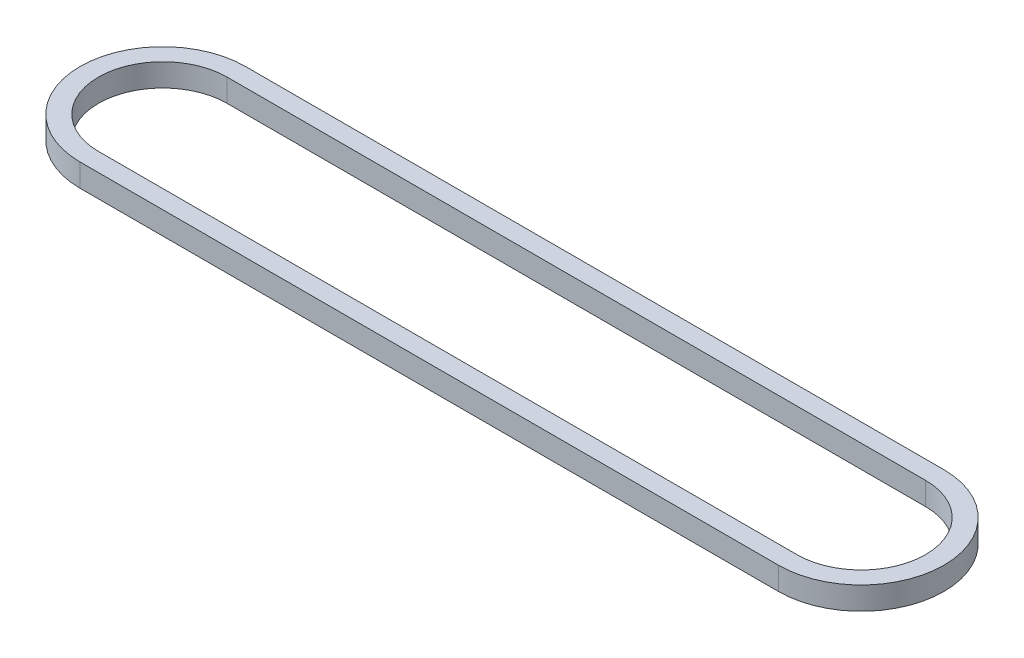
ISO-10303-21;
HEADER;
FILE_DESCRIPTION(('STEP AP214'),'2;1');
FILE_NAME('part.step','',(''),(''),'','','');
FILE_SCHEMA(('AUTOMOTIVE_DESIGN { 1 0 10303 214 1 1 1 1 }'));
ENDSEC;
DATA;
#1=APPLICATION_CONTEXT('core data for automotive mechanical design processes');
#2=APPLICATION_PROTOCOL_DEFINITION('international standard','automotive_design',2000,#1);
#3=PRODUCT_CONTEXT('',#1,'mechanical');
#4=PRODUCT('Part','Part','',(#3));
#5=PRODUCT_RELATED_PRODUCT_CATEGORY('part','',(#4));
#6=PRODUCT_DEFINITION_FORMATION('','',#4);
#7=PRODUCT_DEFINITION_CONTEXT('part definition',#1,'design');
#8=PRODUCT_DEFINITION('design','',#6,#7);
#9=PRODUCT_DEFINITION_SHAPE('','',#8);
#10=(LENGTH_UNIT() NAMED_UNIT(*) SI_UNIT(.MILLI.,.METRE.));
#11=(NAMED_UNIT(*) PLANE_ANGLE_UNIT() SI_UNIT($,.RADIAN.));
#12=(NAMED_UNIT(*) SI_UNIT($,.STERADIAN.) SOLID_ANGLE_UNIT());
#13=UNCERTAINTY_MEASURE_WITH_UNIT(LENGTH_MEASURE(1.E-05),#10,'distance_accuracy_value','');
#14=(GEOMETRIC_REPRESENTATION_CONTEXT(3) GLOBAL_UNCERTAINTY_ASSIGNED_CONTEXT((#13)) GLOBAL_UNIT_ASSIGNED_CONTEXT((#10,
#11,#12)) REPRESENTATION_CONTEXT('',''));
#15=CARTESIAN_POINT('',(0.,0.,0.));
#16=DIRECTION('',(0.,0.,1.));
#17=DIRECTION('',(1.,0.,0.));
#18=AXIS2_PLACEMENT_3D('',#15,#16,#17);
#19=CARTESIAN_POINT('',(0.,7.874,0.));
#20=DIRECTION('',(0.,1.,0.));
#21=DIRECTION('',(0.,0.,1.));
#22=AXIS2_PLACEMENT_3D('',#19,#20,#21);
#23=PLANE('',#22);
#24=CARTESIAN_POINT('',(0.,7.874,0.));
#25=DIRECTION('',(0.,1.,0.));
#26=DIRECTION('',(0.,0.,1.));
#27=AXIS2_PLACEMENT_3D('',#24,#25,#26);
#28=CIRCLE('',#27,28.575);
#29=CARTESIAN_POINT('',(0.,7.874,-28.575));
#30=VERTEX_POINT('',#29);
#31=CARTESIAN_POINT('',(0.,7.874,28.575));
#32=VERTEX_POINT('',#31);
#33=EDGE_CURVE('E159',#30,#32,#28,.T.);
#34=ORIENTED_EDGE('',*,*,#33,.T.);
#35=DIRECTION('',(1.,0.,0.));
#36=VECTOR('',#35,1.);
#37=CARTESIAN_POINT('',(0.,7.874,28.575));
#38=LINE('',#37,#36);
#39=CARTESIAN_POINT('',(241.3,7.874,28.575));
#40=VERTEX_POINT('',#39);
#41=EDGE_CURVE('E163',#32,#40,#38,.T.);
#42=ORIENTED_EDGE('',*,*,#41,.T.);
#43=CARTESIAN_POINT('',(241.3,7.874,0.));
#44=DIRECTION('',(0.,1.,0.));
#45=DIRECTION('',(0.,0.,1.));
#46=AXIS2_PLACEMENT_3D('',#43,#44,#45);
#47=CIRCLE('',#46,28.575);
#48=CARTESIAN_POINT('',(241.3,7.874,-28.575));
#49=VERTEX_POINT('',#48);
#50=EDGE_CURVE('E167',#40,#49,#47,.T.);
#51=ORIENTED_EDGE('',*,*,#50,.T.);
#52=DIRECTION('',(-1.,0.,0.));
#53=VECTOR('',#52,1.);
#54=CARTESIAN_POINT('',(0.,7.874,-28.575));
#55=LINE('',#54,#53);
#56=EDGE_CURVE('E170',#49,#30,#55,.T.);
#57=ORIENTED_EDGE('',*,*,#56,.T.);
#58=EDGE_LOOP('',(#34,#42,#51,#57));
#59=FACE_BOUND('',#58,.T.);
#60=DIRECTION('',(1.,0.,0.));
#61=VECTOR('',#60,1.);
#62=CARTESIAN_POINT('',(0.,7.874,22.225));
#63=LINE('',#62,#61);
#64=CARTESIAN_POINT('',(0.,7.874,22.225));
#65=VERTEX_POINT('',#64);
#66=CARTESIAN_POINT('',(241.3,7.874,22.225));
#67=VERTEX_POINT('',#66);
#68=EDGE_CURVE('E120',#65,#67,#63,.T.);
#69=ORIENTED_EDGE('',*,*,#68,.F.);
#70=CARTESIAN_POINT('',(0.,7.874,0.));
#71=DIRECTION('',(0.,1.,0.));
#72=DIRECTION('',(0.,0.,1.));
#73=AXIS2_PLACEMENT_3D('',#70,#71,#72);
#74=CIRCLE('',#73,22.225);
#75=CARTESIAN_POINT('',(0.,7.874,-22.225));
#76=VERTEX_POINT('',#75);
#77=EDGE_CURVE('E111',#76,#65,#74,.T.);
#78=ORIENTED_EDGE('',*,*,#77,.F.);
#79=DIRECTION('',(-1.,0.,0.));
#80=VECTOR('',#79,1.);
#81=CARTESIAN_POINT('',(0.,7.874,-22.225));
#82=LINE('',#81,#80);
#83=CARTESIAN_POINT('',(241.3,7.874,-22.225));
#84=VERTEX_POINT('',#83);
#85=EDGE_CURVE('E137',#84,#76,#82,.T.);
#86=ORIENTED_EDGE('',*,*,#85,.F.);
#87=CARTESIAN_POINT('',(241.3,7.874,0.));
#88=DIRECTION('',(0.,1.,0.));
#89=DIRECTION('',(0.,0.,1.));
#90=AXIS2_PLACEMENT_3D('',#87,#88,#89);
#91=CIRCLE('',#90,22.225);
#92=EDGE_CURVE('E133',#67,#84,#91,.T.);
#93=ORIENTED_EDGE('',*,*,#92,.F.);
#94=EDGE_LOOP('',(#69,#78,#86,#93));
#95=FACE_BOUND('',#94,.T.);
#96=ADVANCED_FACE('F45',(#59,#95),#23,.T.);
#97=CARTESIAN_POINT('',(0.,0.,0.));
#98=DIRECTION('',(0.,1.,0.));
#99=DIRECTION('',(0.,0.,1.));
#100=AXIS2_PLACEMENT_3D('',#97,#98,#99);
#101=PLANE('',#100);
#102=CARTESIAN_POINT('',(0.,0.,0.));
#103=DIRECTION('',(0.,1.,0.));
#104=DIRECTION('',(0.,0.,1.));
#105=AXIS2_PLACEMENT_3D('',#102,#103,#104);
#106=CIRCLE('',#105,28.575);
#107=CARTESIAN_POINT('',(0.,0.,-28.575));
#108=VERTEX_POINT('',#107);
#109=CARTESIAN_POINT('',(0.,0.,28.575));
#110=VERTEX_POINT('',#109);
#111=EDGE_CURVE('E129',#108,#110,#106,.T.);
#112=ORIENTED_EDGE('',*,*,#111,.F.);
#113=DIRECTION('',(-1.,0.,0.));
#114=VECTOR('',#113,1.);
#115=CARTESIAN_POINT('',(0.,0.,-28.575));
#116=LINE('',#115,#114);
#117=CARTESIAN_POINT('',(241.3,0.,-28.575));
#118=VERTEX_POINT('',#117);
#119=EDGE_CURVE('E164',#118,#108,#116,.T.);
#120=ORIENTED_EDGE('',*,*,#119,.F.);
#121=CARTESIAN_POINT('',(241.3,0.,0.));
#122=DIRECTION('',(0.,1.,0.));
#123=DIRECTION('',(0.,0.,1.));
#124=AXIS2_PLACEMENT_3D('',#121,#122,#123);
#125=CIRCLE('',#124,28.575);
#126=CARTESIAN_POINT('',(241.3,0.,28.575));
#127=VERTEX_POINT('',#126);
#128=EDGE_CURVE('E180',#127,#118,#125,.T.);
#129=ORIENTED_EDGE('',*,*,#128,.F.);
#130=DIRECTION('',(1.,0.,0.));
#131=VECTOR('',#130,1.);
#132=CARTESIAN_POINT('',(0.,0.,28.575));
#133=LINE('',#132,#131);
#134=EDGE_CURVE('E177',#110,#127,#133,.T.);
#135=ORIENTED_EDGE('',*,*,#134,.F.);
#136=EDGE_LOOP('',(#112,#120,#129,#135));
#137=FACE_BOUND('',#136,.T.);
#138=CARTESIAN_POINT('',(0.,0.,0.));
#139=DIRECTION('',(0.,1.,0.));
#140=DIRECTION('',(0.,0.,1.));
#141=AXIS2_PLACEMENT_3D('',#138,#139,#140);
#142=CIRCLE('',#141,22.225);
#143=CARTESIAN_POINT('',(0.,0.,-22.225));
#144=VERTEX_POINT('',#143);
#145=CARTESIAN_POINT('',(0.,0.,22.225));
#146=VERTEX_POINT('',#145);
#147=EDGE_CURVE('E69',#144,#146,#142,.T.);
#148=ORIENTED_EDGE('',*,*,#147,.T.);
#149=DIRECTION('',(1.,0.,0.));
#150=VECTOR('',#149,1.);
#151=CARTESIAN_POINT('',(0.,0.,22.225));
#152=LINE('',#151,#150);
#153=CARTESIAN_POINT('',(241.3,0.,22.225));
#154=VERTEX_POINT('',#153);
#155=EDGE_CURVE('E127',#146,#154,#152,.T.);
#156=ORIENTED_EDGE('',*,*,#155,.T.);
#157=CARTESIAN_POINT('',(241.3,0.,0.));
#158=DIRECTION('',(0.,1.,0.));
#159=DIRECTION('',(0.,0.,1.));
#160=AXIS2_PLACEMENT_3D('',#157,#158,#159);
#161=CIRCLE('',#160,22.225);
#162=CARTESIAN_POINT('',(241.3,0.,-22.225));
#163=VERTEX_POINT('',#162);
#164=EDGE_CURVE('E146',#154,#163,#161,.T.);
#165=ORIENTED_EDGE('',*,*,#164,.T.);
#166=DIRECTION('',(-1.,0.,0.));
#167=VECTOR('',#166,1.);
#168=CARTESIAN_POINT('',(0.,0.,-22.225));
#169=LINE('',#168,#167);
#170=EDGE_CURVE('E121',#163,#144,#169,.T.);
#171=ORIENTED_EDGE('',*,*,#170,.T.);
#172=EDGE_LOOP('',(#148,#156,#165,#171));
#173=FACE_BOUND('',#172,.T.);
#174=ADVANCED_FACE('F203',(#137,#173),#101,.F.);
#175=CARTESIAN_POINT('',(0.,7.874,0.));
#176=DIRECTION('',(0.,-1.,0.));
#177=DIRECTION('',(0.,0.,-1.));
#178=AXIS2_PLACEMENT_3D('',#175,#176,#177);
#179=CYLINDRICAL_SURFACE('',#178,28.575);
#180=ORIENTED_EDGE('',*,*,#111,.T.);
#181=DIRECTION('',(0.,-1.,0.));
#182=VECTOR('',#181,1.);
#183=CARTESIAN_POINT('',(0.,7.874,28.575));
#184=LINE('',#183,#182);
#185=EDGE_CURVE('E11',#32,#110,#184,.T.);
#186=ORIENTED_EDGE('',*,*,#185,.F.);
#187=ORIENTED_EDGE('',*,*,#33,.F.);
#188=DIRECTION('',(0.,-1.,0.));
#189=VECTOR('',#188,1.);
#190=CARTESIAN_POINT('',(0.,7.874,-28.575));
#191=LINE('',#190,#189);
#192=EDGE_CURVE('E173',#30,#108,#191,.T.);
#193=ORIENTED_EDGE('',*,*,#192,.T.);
#194=EDGE_LOOP('',(#180,#186,#187,#193));
#195=FACE_BOUND('',#194,.T.);
#196=ADVANCED_FACE('F47',(#195),#179,.T.);
#197=CARTESIAN_POINT('',(0.,7.874,28.575));
#198=DIRECTION('',(0.,0.,-1.));
#199=DIRECTION('',(-1.,0.,0.));
#200=AXIS2_PLACEMENT_3D('',#197,#198,#199);
#201=PLANE('',#200);
#202=ORIENTED_EDGE('',*,*,#134,.T.);
#203=DIRECTION('',(0.,-1.,0.));
#204=VECTOR('',#203,1.);
#205=CARTESIAN_POINT('',(241.3,7.874,28.575));
#206=LINE('',#205,#204);
#207=EDGE_CURVE('E54',#40,#127,#206,.T.);
#208=ORIENTED_EDGE('',*,*,#207,.F.);
#209=ORIENTED_EDGE('',*,*,#41,.F.);
#210=ORIENTED_EDGE('',*,*,#185,.T.);
#211=EDGE_LOOP('',(#202,#208,#209,#210));
#212=FACE_BOUND('',#211,.T.);
#213=ADVANCED_FACE('F213',(#212),#201,.F.);
#214=CARTESIAN_POINT('',(241.3,7.874,0.));
#215=DIRECTION('',(0.,-1.,0.));
#216=DIRECTION('',(0.,0.,-1.));
#217=AXIS2_PLACEMENT_3D('',#214,#215,#216);
#218=CYLINDRICAL_SURFACE('',#217,28.575);
#219=ORIENTED_EDGE('',*,*,#128,.T.);
#220=DIRECTION('',(0.,-1.,0.));
#221=VECTOR('',#220,1.);
#222=CARTESIAN_POINT('',(241.3,7.874,-28.575));
#223=LINE('',#222,#221);
#224=EDGE_CURVE('E188',#49,#118,#223,.T.);
#225=ORIENTED_EDGE('',*,*,#224,.F.);
#226=ORIENTED_EDGE('',*,*,#50,.F.);
#227=ORIENTED_EDGE('',*,*,#207,.T.);
#228=EDGE_LOOP('',(#219,#225,#226,#227));
#229=FACE_BOUND('',#228,.T.);
#230=ADVANCED_FACE('F197',(#229),#218,.T.);
#231=CARTESIAN_POINT('',(0.,7.874,-28.575));
#232=DIRECTION('',(0.,0.,1.));
#233=DIRECTION('',(1.,0.,0.));
#234=AXIS2_PLACEMENT_3D('',#231,#232,#233);
#235=PLANE('',#234);
#236=ORIENTED_EDGE('',*,*,#119,.T.);
#237=ORIENTED_EDGE('',*,*,#192,.F.);
#238=ORIENTED_EDGE('',*,*,#56,.F.);
#239=ORIENTED_EDGE('',*,*,#224,.T.);
#240=EDGE_LOOP('',(#236,#237,#238,#239));
#241=FACE_BOUND('',#240,.T.);
#242=ADVANCED_FACE('F207',(#241),#235,.F.);
#243=CARTESIAN_POINT('',(0.,7.874,0.));
#244=DIRECTION('',(0.,-1.,0.));
#245=DIRECTION('',(0.,0.,-1.));
#246=AXIS2_PLACEMENT_3D('',#243,#244,#245);
#247=CYLINDRICAL_SURFACE('',#246,22.225);
#248=ORIENTED_EDGE('',*,*,#147,.F.);
#249=DIRECTION('',(0.,-1.,0.));
#250=VECTOR('',#249,1.);
#251=CARTESIAN_POINT('',(0.,7.874,-22.225));
#252=LINE('',#251,#250);
#253=EDGE_CURVE('E115',#76,#144,#252,.T.);
#254=ORIENTED_EDGE('',*,*,#253,.F.);
#255=ORIENTED_EDGE('',*,*,#77,.T.);
#256=DIRECTION('',(0.,-1.,0.));
#257=VECTOR('',#256,1.);
#258=CARTESIAN_POINT('',(0.,7.874,22.225));
#259=LINE('',#258,#257);
#260=EDGE_CURVE('E114',#65,#146,#259,.T.);
#261=ORIENTED_EDGE('',*,*,#260,.T.);
#262=EDGE_LOOP('',(#248,#254,#255,#261));
#263=FACE_BOUND('',#262,.T.);
#264=ADVANCED_FACE('F113',(#263),#247,.F.);
#265=CARTESIAN_POINT('',(0.,7.874,22.225));
#266=DIRECTION('',(0.,0.,-1.));
#267=DIRECTION('',(-1.,0.,0.));
#268=AXIS2_PLACEMENT_3D('',#265,#266,#267);
#269=PLANE('',#268);
#270=ORIENTED_EDGE('',*,*,#155,.F.);
#271=ORIENTED_EDGE('',*,*,#260,.F.);
#272=ORIENTED_EDGE('',*,*,#68,.T.);
#273=DIRECTION('',(0.,-1.,0.));
#274=VECTOR('',#273,1.);
#275=CARTESIAN_POINT('',(241.3,7.874,22.225));
#276=LINE('',#275,#274);
#277=EDGE_CURVE('E130',#67,#154,#276,.T.);
#278=ORIENTED_EDGE('',*,*,#277,.T.);
#279=EDGE_LOOP('',(#270,#271,#272,#278));
#280=FACE_BOUND('',#279,.T.);
#281=ADVANCED_FACE('F124',(#280),#269,.T.);
#282=CARTESIAN_POINT('',(241.3,7.874,0.));
#283=DIRECTION('',(0.,-1.,0.));
#284=DIRECTION('',(0.,0.,-1.));
#285=AXIS2_PLACEMENT_3D('',#282,#283,#284);
#286=CYLINDRICAL_SURFACE('',#285,22.225);
#287=ORIENTED_EDGE('',*,*,#164,.F.);
#288=ORIENTED_EDGE('',*,*,#277,.F.);
#289=ORIENTED_EDGE('',*,*,#92,.T.);
#290=DIRECTION('',(0.,-1.,0.));
#291=VECTOR('',#290,1.);
#292=CARTESIAN_POINT('',(241.3,7.874,-22.225));
#293=LINE('',#292,#291);
#294=EDGE_CURVE('E61',#84,#163,#293,.T.);
#295=ORIENTED_EDGE('',*,*,#294,.T.);
#296=EDGE_LOOP('',(#287,#288,#289,#295));
#297=FACE_BOUND('',#296,.T.);
#298=ADVANCED_FACE('F236',(#297),#286,.F.);
#299=CARTESIAN_POINT('',(0.,7.874,-22.225));
#300=DIRECTION('',(0.,0.,1.));
#301=DIRECTION('',(1.,0.,0.));
#302=AXIS2_PLACEMENT_3D('',#299,#300,#301);
#303=PLANE('',#302);
#304=ORIENTED_EDGE('',*,*,#170,.F.);
#305=ORIENTED_EDGE('',*,*,#294,.F.);
#306=ORIENTED_EDGE('',*,*,#85,.T.);
#307=ORIENTED_EDGE('',*,*,#253,.T.);
#308=EDGE_LOOP('',(#304,#305,#306,#307));
#309=FACE_BOUND('',#308,.T.);
#310=ADVANCED_FACE('F240',(#309),#303,.T.);
#311=CLOSED_SHELL('',(#96,#174,#196,#213,#230,#242,#264,#281,#298,#310));
#312=MANIFOLD_SOLID_BREP('B2',#311);
#313=ADVANCED_BREP_SHAPE_REPRESENTATION('',(#18,#312),#14);
#314=SHAPE_DEFINITION_REPRESENTATION(#9,#313);
ENDSEC;
END-ISO-10303-21;
